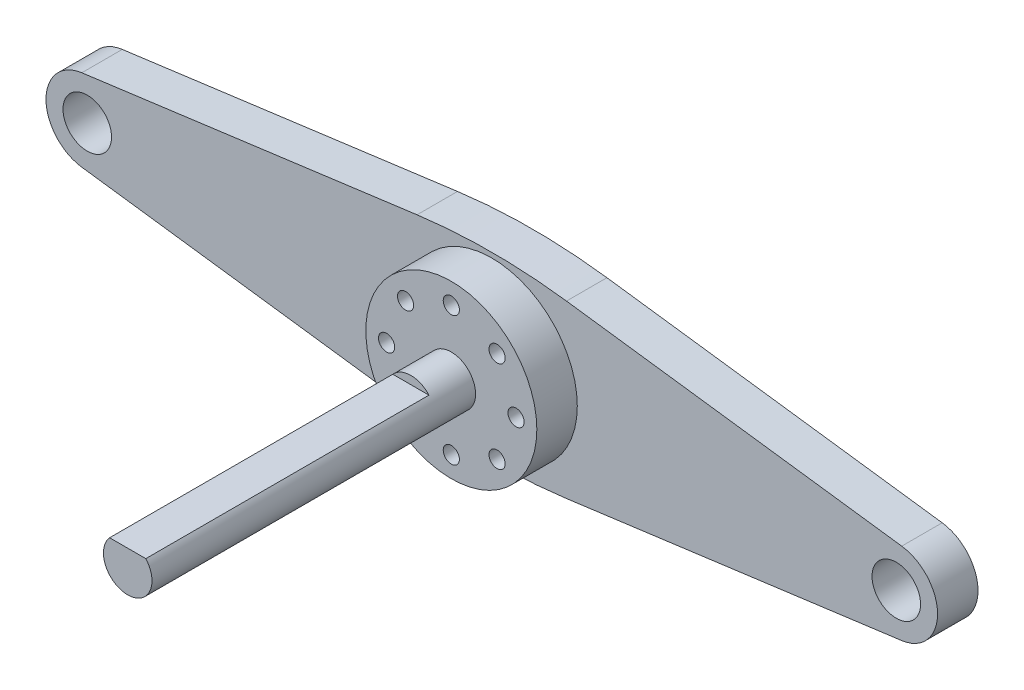
ISO-10303-21;
HEADER;
FILE_DESCRIPTION(('STEP AP214'),'2;1');
FILE_NAME('part.step','',(''),(''),'','','');
FILE_SCHEMA(('AUTOMOTIVE_DESIGN { 1 0 10303 214 1 1 1 1 }'));
ENDSEC;
DATA;
#1=APPLICATION_CONTEXT('core data for automotive mechanical design processes');
#2=APPLICATION_PROTOCOL_DEFINITION('international standard','automotive_design',2000,#1);
#3=PRODUCT_CONTEXT('',#1,'mechanical');
#4=PRODUCT('Part','Part','',(#3));
#5=PRODUCT_RELATED_PRODUCT_CATEGORY('part','',(#4));
#6=PRODUCT_DEFINITION_FORMATION('','',#4);
#7=PRODUCT_DEFINITION_CONTEXT('part definition',#1,'design');
#8=PRODUCT_DEFINITION('design','',#6,#7);
#9=PRODUCT_DEFINITION_SHAPE('','',#8);
#10=(LENGTH_UNIT() NAMED_UNIT(*) SI_UNIT(.MILLI.,.METRE.));
#11=(NAMED_UNIT(*) PLANE_ANGLE_UNIT() SI_UNIT($,.RADIAN.));
#12=(NAMED_UNIT(*) SI_UNIT($,.STERADIAN.) SOLID_ANGLE_UNIT());
#13=UNCERTAINTY_MEASURE_WITH_UNIT(LENGTH_MEASURE(1.E-05),#10,'distance_accuracy_value','');
#14=(GEOMETRIC_REPRESENTATION_CONTEXT(3) GLOBAL_UNCERTAINTY_ASSIGNED_CONTEXT((#13)) GLOBAL_UNIT_ASSIGNED_CONTEXT((#10,
#11,#12)) REPRESENTATION_CONTEXT('',''));
#15=CARTESIAN_POINT('',(0.,0.,0.));
#16=DIRECTION('',(0.,0.,1.));
#17=DIRECTION('',(1.,0.,0.));
#18=AXIS2_PLACEMENT_3D('',#15,#16,#17);
#19=CARTESIAN_POINT('',(-5.65685424949245,-5.65685424949231,5.));
#20=DIRECTION('',(0.,0.,-1.));
#21=DIRECTION('',(-1.,0.,0.));
#22=AXIS2_PLACEMENT_3D('',#19,#20,#21);
#23=CYLINDRICAL_SURFACE('',#22,1.);
#24=CARTESIAN_POINT('',(-5.65685424949245,-5.65685424949231,0.));
#25=DIRECTION('',(0.,0.,1.));
#26=DIRECTION('',(1.,0.,0.));
#27=AXIS2_PLACEMENT_3D('',#24,#25,#26);
#28=CIRCLE('',#27,1.);
#29=CARTESIAN_POINT('',(-4.65685424949245,-5.65685424949231,0.));
#30=VERTEX_POINT('',#29);
#31=EDGE_CURVE('E219',#30,#30,#28,.T.);
#32=ORIENTED_EDGE('',*,*,#31,.F.);
#33=EDGE_LOOP('',(#32));
#34=FACE_BOUND('',#33,.T.);
#35=CARTESIAN_POINT('',(-5.65685424949245,-5.65685424949231,10.));
#36=DIRECTION('',(0.,0.,1.));
#37=DIRECTION('',(1.,0.,0.));
#38=AXIS2_PLACEMENT_3D('',#35,#36,#37);
#39=CIRCLE('',#38,1.);
#40=CARTESIAN_POINT('',(-4.65685424949245,-5.65685424949231,10.));
#41=VERTEX_POINT('',#40);
#42=EDGE_CURVE('E262',#41,#41,#39,.T.);
#43=ORIENTED_EDGE('',*,*,#42,.T.);
#44=EDGE_LOOP('',(#43));
#45=FACE_BOUND('',#44,.T.);
#46=ADVANCED_FACE('F65',(#34,#45),#23,.F.);
#47=CARTESIAN_POINT('',(0.,-8.,5.));
#48=DIRECTION('',(0.,0.,-1.));
#49=DIRECTION('',(-1.,0.,0.));
#50=AXIS2_PLACEMENT_3D('',#47,#48,#49);
#51=CYLINDRICAL_SURFACE('',#50,1.);
#52=CARTESIAN_POINT('',(0.,-8.,0.));
#53=DIRECTION('',(0.,0.,1.));
#54=DIRECTION('',(1.,0.,0.));
#55=AXIS2_PLACEMENT_3D('',#52,#53,#54);
#56=CIRCLE('',#55,1.);
#57=CARTESIAN_POINT('',(0.999999999999915,-8.,0.));
#58=VERTEX_POINT('',#57);
#59=EDGE_CURVE('E216',#58,#58,#56,.T.);
#60=ORIENTED_EDGE('',*,*,#59,.F.);
#61=EDGE_LOOP('',(#60));
#62=FACE_BOUND('',#61,.T.);
#63=CARTESIAN_POINT('',(0.,-8.,10.));
#64=DIRECTION('',(0.,0.,1.));
#65=DIRECTION('',(1.,0.,0.));
#66=AXIS2_PLACEMENT_3D('',#63,#64,#65);
#67=CIRCLE('',#66,1.);
#68=CARTESIAN_POINT('',(0.999999999999915,-8.,10.));
#69=VERTEX_POINT('',#68);
#70=EDGE_CURVE('E265',#69,#69,#67,.T.);
#71=ORIENTED_EDGE('',*,*,#70,.T.);
#72=EDGE_LOOP('',(#71));
#73=FACE_BOUND('',#72,.T.);
#74=ADVANCED_FACE('F326',(#62,#73),#51,.F.);
#75=CARTESIAN_POINT('',(5.65685424949233,-5.65685424949243,5.));
#76=DIRECTION('',(0.,0.,-1.));
#77=DIRECTION('',(-1.,0.,0.));
#78=AXIS2_PLACEMENT_3D('',#75,#76,#77);
#79=CYLINDRICAL_SURFACE('',#78,1.);
#80=CARTESIAN_POINT('',(5.65685424949233,-5.65685424949243,0.));
#81=DIRECTION('',(0.,0.,1.));
#82=DIRECTION('',(1.,0.,0.));
#83=AXIS2_PLACEMENT_3D('',#80,#81,#82);
#84=CIRCLE('',#83,1.);
#85=CARTESIAN_POINT('',(6.65685424949233,-5.65685424949243,0.));
#86=VERTEX_POINT('',#85);
#87=EDGE_CURVE('E213',#86,#86,#84,.T.);
#88=ORIENTED_EDGE('',*,*,#87,.F.);
#89=EDGE_LOOP('',(#88));
#90=FACE_BOUND('',#89,.T.);
#91=CARTESIAN_POINT('',(5.65685424949233,-5.65685424949243,10.));
#92=DIRECTION('',(0.,0.,1.));
#93=DIRECTION('',(1.,0.,0.));
#94=AXIS2_PLACEMENT_3D('',#91,#92,#93);
#95=CIRCLE('',#94,1.);
#96=CARTESIAN_POINT('',(6.65685424949233,-5.65685424949243,10.));
#97=VERTEX_POINT('',#96);
#98=EDGE_CURVE('E268',#97,#97,#95,.T.);
#99=ORIENTED_EDGE('',*,*,#98,.T.);
#100=EDGE_LOOP('',(#99));
#101=FACE_BOUND('',#100,.T.);
#102=ADVANCED_FACE('F332',(#90,#101),#79,.F.);
#103=CARTESIAN_POINT('',(8.,0.,5.));
#104=DIRECTION('',(0.,0.,-1.));
#105=DIRECTION('',(-1.,0.,0.));
#106=AXIS2_PLACEMENT_3D('',#103,#104,#105);
#107=CYLINDRICAL_SURFACE('',#106,0.999999999999999);
#108=CARTESIAN_POINT('',(8.,0.,0.));
#109=DIRECTION('',(0.,0.,1.));
#110=DIRECTION('',(1.,0.,0.));
#111=AXIS2_PLACEMENT_3D('',#108,#109,#110);
#112=CIRCLE('',#111,0.999999999999999);
#113=CARTESIAN_POINT('',(9.,0.,0.));
#114=VERTEX_POINT('',#113);
#115=EDGE_CURVE('E210',#114,#114,#112,.T.);
#116=ORIENTED_EDGE('',*,*,#115,.F.);
#117=EDGE_LOOP('',(#116));
#118=FACE_BOUND('',#117,.T.);
#119=CARTESIAN_POINT('',(8.,0.,10.));
#120=DIRECTION('',(0.,0.,1.));
#121=DIRECTION('',(1.,0.,0.));
#122=AXIS2_PLACEMENT_3D('',#119,#120,#121);
#123=CIRCLE('',#122,0.999999999999999);
#124=CARTESIAN_POINT('',(9.,0.,10.));
#125=VERTEX_POINT('',#124);
#126=EDGE_CURVE('E271',#125,#125,#123,.T.);
#127=ORIENTED_EDGE('',*,*,#126,.T.);
#128=EDGE_LOOP('',(#127));
#129=FACE_BOUND('',#128,.T.);
#130=ADVANCED_FACE('F342',(#118,#129),#107,.F.);
#131=CARTESIAN_POINT('',(5.65685424949241,5.65685424949235,5.));
#132=DIRECTION('',(0.,0.,-1.));
#133=DIRECTION('',(-1.,0.,0.));
#134=AXIS2_PLACEMENT_3D('',#131,#132,#133);
#135=CYLINDRICAL_SURFACE('',#134,0.999999999999999);
#136=CARTESIAN_POINT('',(5.65685424949241,5.65685424949235,0.));
#137=DIRECTION('',(0.,0.,1.));
#138=DIRECTION('',(1.,0.,0.));
#139=AXIS2_PLACEMENT_3D('',#136,#137,#138);
#140=CIRCLE('',#139,0.999999999999999);
#141=CARTESIAN_POINT('',(6.65685424949241,5.65685424949235,0.));
#142=VERTEX_POINT('',#141);
#143=EDGE_CURVE('E207',#142,#142,#140,.T.);
#144=ORIENTED_EDGE('',*,*,#143,.F.);
#145=EDGE_LOOP('',(#144));
#146=FACE_BOUND('',#145,.T.);
#147=CARTESIAN_POINT('',(5.65685424949241,5.65685424949235,10.));
#148=DIRECTION('',(0.,0.,1.));
#149=DIRECTION('',(1.,0.,0.));
#150=AXIS2_PLACEMENT_3D('',#147,#148,#149);
#151=CIRCLE('',#150,0.999999999999999);
#152=CARTESIAN_POINT('',(6.65685424949241,5.65685424949235,10.));
#153=VERTEX_POINT('',#152);
#154=EDGE_CURVE('E274',#153,#153,#151,.T.);
#155=ORIENTED_EDGE('',*,*,#154,.T.);
#156=EDGE_LOOP('',(#155));
#157=FACE_BOUND('',#156,.T.);
#158=ADVANCED_FACE('F346',(#146,#157),#135,.F.);
#159=CARTESIAN_POINT('',(0.,8.,5.));
#160=DIRECTION('',(0.,0.,-1.));
#161=DIRECTION('',(-1.,0.,0.));
#162=AXIS2_PLACEMENT_3D('',#159,#160,#161);
#163=CYLINDRICAL_SURFACE('',#162,1.);
#164=CARTESIAN_POINT('',(0.,8.,0.));
#165=DIRECTION('',(0.,0.,1.));
#166=DIRECTION('',(1.,0.,0.));
#167=AXIS2_PLACEMENT_3D('',#164,#165,#166);
#168=CIRCLE('',#167,1.);
#169=CARTESIAN_POINT('',(1.00000000000003,8.,0.));
#170=VERTEX_POINT('',#169);
#171=EDGE_CURVE('E204',#170,#170,#168,.T.);
#172=ORIENTED_EDGE('',*,*,#171,.F.);
#173=EDGE_LOOP('',(#172));
#174=FACE_BOUND('',#173,.T.);
#175=CARTESIAN_POINT('',(0.,8.,10.));
#176=DIRECTION('',(0.,0.,1.));
#177=DIRECTION('',(1.,0.,0.));
#178=AXIS2_PLACEMENT_3D('',#175,#176,#177);
#179=CIRCLE('',#178,1.);
#180=CARTESIAN_POINT('',(1.00000000000003,8.,10.));
#181=VERTEX_POINT('',#180);
#182=EDGE_CURVE('E277',#181,#181,#179,.T.);
#183=ORIENTED_EDGE('',*,*,#182,.T.);
#184=EDGE_LOOP('',(#183));
#185=FACE_BOUND('',#184,.T.);
#186=ADVANCED_FACE('F350',(#174,#185),#163,.F.);
#187=CARTESIAN_POINT('',(-8.,0.,5.));
#188=DIRECTION('',(0.,0.,-1.));
#189=DIRECTION('',(-1.,0.,0.));
#190=AXIS2_PLACEMENT_3D('',#187,#188,#189);
#191=CYLINDRICAL_SURFACE('',#190,1.);
#192=CARTESIAN_POINT('',(-8.,0.,0.));
#193=DIRECTION('',(0.,0.,1.));
#194=DIRECTION('',(1.,0.,0.));
#195=AXIS2_PLACEMENT_3D('',#192,#193,#194);
#196=CIRCLE('',#195,1.);
#197=CARTESIAN_POINT('',(-7.,0.,0.));
#198=VERTEX_POINT('',#197);
#199=EDGE_CURVE('E201',#198,#198,#196,.T.);
#200=ORIENTED_EDGE('',*,*,#199,.F.);
#201=EDGE_LOOP('',(#200));
#202=FACE_BOUND('',#201,.T.);
#203=CARTESIAN_POINT('',(-8.,0.,10.));
#204=DIRECTION('',(0.,0.,1.));
#205=DIRECTION('',(1.,0.,0.));
#206=AXIS2_PLACEMENT_3D('',#203,#204,#205);
#207=CIRCLE('',#206,1.);
#208=CARTESIAN_POINT('',(-7.,0.,10.));
#209=VERTEX_POINT('',#208);
#210=EDGE_CURVE('E280',#209,#209,#207,.T.);
#211=ORIENTED_EDGE('',*,*,#210,.T.);
#212=EDGE_LOOP('',(#211));
#213=FACE_BOUND('',#212,.T.);
#214=ADVANCED_FACE('F354',(#202,#213),#191,.F.);
#215=CARTESIAN_POINT('',(-5.65685424949237,5.65685424949239,5.));
#216=DIRECTION('',(0.,0.,-1.));
#217=DIRECTION('',(-1.,0.,0.));
#218=AXIS2_PLACEMENT_3D('',#215,#216,#217);
#219=CYLINDRICAL_SURFACE('',#218,0.999999999999999);
#220=CARTESIAN_POINT('',(-5.65685424949237,5.65685424949239,0.));
#221=DIRECTION('',(0.,0.,1.));
#222=DIRECTION('',(1.,0.,0.));
#223=AXIS2_PLACEMENT_3D('',#220,#221,#222);
#224=CIRCLE('',#223,0.999999999999999);
#225=CARTESIAN_POINT('',(-4.65685424949237,5.65685424949239,0.));
#226=VERTEX_POINT('',#225);
#227=EDGE_CURVE('E198',#226,#226,#224,.T.);
#228=ORIENTED_EDGE('',*,*,#227,.F.);
#229=EDGE_LOOP('',(#228));
#230=FACE_BOUND('',#229,.T.);
#231=CARTESIAN_POINT('',(-5.65685424949237,5.65685424949239,10.));
#232=DIRECTION('',(0.,0.,1.));
#233=DIRECTION('',(1.,0.,0.));
#234=AXIS2_PLACEMENT_3D('',#231,#232,#233);
#235=CIRCLE('',#234,0.999999999999999);
#236=CARTESIAN_POINT('',(-4.65685424949237,5.65685424949239,10.));
#237=VERTEX_POINT('',#236);
#238=EDGE_CURVE('E283',#237,#237,#235,.T.);
#239=ORIENTED_EDGE('',*,*,#238,.T.);
#240=EDGE_LOOP('',(#239));
#241=FACE_BOUND('',#240,.T.);
#242=ADVANCED_FACE('F358',(#230,#241),#219,.F.);
#243=CARTESIAN_POINT('',(0.,58.8173671567806,5.));
#244=DIRECTION('',(0.,0.,-1.));
#245=DIRECTION('',(-1.,0.,0.));
#246=AXIS2_PLACEMENT_3D('',#243,#244,#245);
#247=CYLINDRICAL_SURFACE('',#246,70.);
#248=CARTESIAN_POINT('',(0.,58.8173671567806,0.));
#249=DIRECTION('',(0.,0.,1.));
#250=DIRECTION('',(1.,0.,0.));
#251=AXIS2_PLACEMENT_3D('',#248,#249,#250);
#252=CIRCLE('',#251,70.);
#253=CARTESIAN_POINT('',(-9.23511167640649,-10.5707637614413,0.));
#254=VERTEX_POINT('',#253);
#255=CARTESIAN_POINT('',(9.23511167640649,-10.5707637614413,0.));
#256=VERTEX_POINT('',#255);
#257=EDGE_CURVE('E182',#254,#256,#252,.T.);
#258=ORIENTED_EDGE('',*,*,#257,.T.);
#259=DIRECTION('',(0.,0.,-1.));
#260=VECTOR('',#259,1.);
#261=CARTESIAN_POINT('',(9.23511167640649,-10.5707637614413,5.));
#262=LINE('',#261,#260);
#263=CARTESIAN_POINT('',(9.23511167640649,-10.5707637614413,5.));
#264=VERTEX_POINT('',#263);
#265=EDGE_CURVE('E74',#264,#256,#262,.T.);
#266=ORIENTED_EDGE('',*,*,#265,.F.);
#267=CARTESIAN_POINT('',(0.,58.8173671567806,5.));
#268=DIRECTION('',(0.,0.,1.));
#269=DIRECTION('',(1.,0.,0.));
#270=AXIS2_PLACEMENT_3D('',#267,#268,#269);
#271=CIRCLE('',#270,70.);
#272=CARTESIAN_POINT('',(-9.23511167640649,-10.5707637614413,5.));
#273=VERTEX_POINT('',#272);
#274=EDGE_CURVE('E130',#273,#264,#271,.T.);
#275=ORIENTED_EDGE('',*,*,#274,.F.);
#276=DIRECTION('',(0.,0.,-1.));
#277=VECTOR('',#276,1.);
#278=CARTESIAN_POINT('',(-9.23511167640649,-10.5707637614413,5.));
#279=LINE('',#278,#277);
#280=EDGE_CURVE('E12',#273,#254,#279,.T.);
#281=ORIENTED_EDGE('',*,*,#280,.T.);
#282=EDGE_LOOP('',(#258,#266,#275,#281));
#283=FACE_BOUND('',#282,.T.);
#284=ADVANCED_FACE('F236',(#283),#247,.T.);
#285=CARTESIAN_POINT('',(1.54315479575544,-11.5945134987938,5.));
#286=DIRECTION('',(0.131930166805804,-0.991259013117456,0.));
#287=DIRECTION('',(0.991259013117456,0.131930166805804,0.));
#288=AXIS2_PLACEMENT_3D('',#285,#286,#287);
#289=PLANE('',#288);
#290=DIRECTION('',(-0.991259013117456,-0.131930166805804,0.));
#291=VECTOR('',#290,1.);
#292=CARTESIAN_POINT('',(1.54315479575544,-11.5945134987938,0.));
#293=LINE('',#292,#291);
#294=CARTESIAN_POINT('',(50.6728763500851,-5.05566515137672,0.));
#295=VERTEX_POINT('',#294);
#296=EDGE_CURVE('E185',#295,#256,#293,.T.);
#297=ORIENTED_EDGE('',*,*,#296,.F.);
#298=DIRECTION('',(0.,0.,-1.));
#299=VECTOR('',#298,1.);
#300=CARTESIAN_POINT('',(50.6728763500851,-5.05566515137672,5.));
#301=LINE('',#300,#299);
#302=CARTESIAN_POINT('',(50.6728763500851,-5.05566515137672,5.));
#303=VERTEX_POINT('',#302);
#304=EDGE_CURVE('E228',#303,#295,#301,.T.);
#305=ORIENTED_EDGE('',*,*,#304,.F.);
#306=DIRECTION('',(-0.991259013117456,-0.131930166805804,0.));
#307=VECTOR('',#306,1.);
#308=CARTESIAN_POINT('',(1.54315479575544,-11.5945134987938,5.));
#309=LINE('',#308,#307);
#310=EDGE_CURVE('E235',#303,#264,#309,.T.);
#311=ORIENTED_EDGE('',*,*,#310,.T.);
#312=ORIENTED_EDGE('',*,*,#265,.T.);
#313=EDGE_LOOP('',(#297,#305,#311,#312));
#314=FACE_BOUND('',#313,.T.);
#315=ADVANCED_FACE('F233',(#314),#289,.T.);
#316=CARTESIAN_POINT('',(50.,0.,5.));
#317=DIRECTION('',(0.,0.,-1.));
#318=DIRECTION('',(-1.,0.,0.));
#319=AXIS2_PLACEMENT_3D('',#316,#317,#318);
#320=CYLINDRICAL_SURFACE('',#319,5.10024633771241);
#321=CARTESIAN_POINT('',(50.,0.,0.));
#322=DIRECTION('',(0.,0.,1.));
#323=DIRECTION('',(1.,0.,0.));
#324=AXIS2_PLACEMENT_3D('',#321,#322,#323);
#325=CIRCLE('',#324,5.10024633771241);
#326=CARTESIAN_POINT('',(50.6728763500851,5.05566515137672,0.));
#327=VERTEX_POINT('',#326);
#328=EDGE_CURVE('E188',#327,#295,#325,.F.);
#329=ORIENTED_EDGE('',*,*,#328,.F.);
#330=DIRECTION('',(0.,0.,-1.));
#331=VECTOR('',#330,1.);
#332=CARTESIAN_POINT('',(50.6728763500851,5.05566515137672,5.));
#333=LINE('',#332,#331);
#334=CARTESIAN_POINT('',(50.6728763500851,5.05566515137672,5.));
#335=VERTEX_POINT('',#334);
#336=EDGE_CURVE('E226',#335,#327,#333,.T.);
#337=ORIENTED_EDGE('',*,*,#336,.F.);
#338=CARTESIAN_POINT('',(50.,0.,5.));
#339=DIRECTION('',(0.,0.,1.));
#340=DIRECTION('',(1.,0.,0.));
#341=AXIS2_PLACEMENT_3D('',#338,#339,#340);
#342=CIRCLE('',#341,5.10024633771241);
#343=EDGE_CURVE('E247',#335,#303,#342,.F.);
#344=ORIENTED_EDGE('',*,*,#343,.T.);
#345=ORIENTED_EDGE('',*,*,#304,.T.);
#346=EDGE_LOOP('',(#329,#337,#344,#345));
#347=FACE_BOUND('',#346,.T.);
#348=ADVANCED_FACE('F245',(#347),#320,.T.);
#349=CARTESIAN_POINT('',(1.54315479575544,11.5945134987938,5.));
#350=DIRECTION('',(-0.131930166805804,-0.991259013117456,0.));
#351=DIRECTION('',(0.991259013117456,-0.131930166805804,0.));
#352=AXIS2_PLACEMENT_3D('',#349,#350,#351);
#353=PLANE('',#352);
#354=DIRECTION('',(-0.991259013117456,0.131930166805804,0.));
#355=VECTOR('',#354,1.);
#356=CARTESIAN_POINT('',(1.54315479575544,11.5945134987938,0.));
#357=LINE('',#356,#355);
#358=CARTESIAN_POINT('',(9.23511167640649,10.5707637614413,0.));
#359=VERTEX_POINT('',#358);
#360=EDGE_CURVE('E191',#327,#359,#357,.T.);
#361=ORIENTED_EDGE('',*,*,#360,.T.);
#362=DIRECTION('',(0.,0.,-1.));
#363=VECTOR('',#362,1.);
#364=CARTESIAN_POINT('',(9.23511167640649,10.5707637614413,5.));
#365=LINE('',#364,#363);
#366=CARTESIAN_POINT('',(9.23511167640649,10.5707637614413,5.));
#367=VERTEX_POINT('',#366);
#368=EDGE_CURVE('E157',#367,#359,#365,.T.);
#369=ORIENTED_EDGE('',*,*,#368,.F.);
#370=DIRECTION('',(-0.991259013117456,0.131930166805804,0.));
#371=VECTOR('',#370,1.);
#372=CARTESIAN_POINT('',(1.54315479575544,11.5945134987938,5.));
#373=LINE('',#372,#371);
#374=EDGE_CURVE('E164',#335,#367,#373,.T.);
#375=ORIENTED_EDGE('',*,*,#374,.F.);
#376=ORIENTED_EDGE('',*,*,#336,.T.);
#377=EDGE_LOOP('',(#361,#369,#375,#376));
#378=FACE_BOUND('',#377,.T.);
#379=ADVANCED_FACE('F371',(#378),#353,.F.);
#380=CARTESIAN_POINT('',(0.,-58.8173671567806,5.));
#381=DIRECTION('',(0.,0.,-1.));
#382=DIRECTION('',(-1.,0.,0.));
#383=AXIS2_PLACEMENT_3D('',#380,#381,#382);
#384=CYLINDRICAL_SURFACE('',#383,70.);
#385=CARTESIAN_POINT('',(0.,-58.8173671567806,0.));
#386=DIRECTION('',(0.,0.,1.));
#387=DIRECTION('',(1.,0.,0.));
#388=AXIS2_PLACEMENT_3D('',#385,#386,#387);
#389=CIRCLE('',#388,70.);
#390=CARTESIAN_POINT('',(-9.23511167640649,10.5707637614413,0.));
#391=VERTEX_POINT('',#390);
#392=EDGE_CURVE('E152',#391,#359,#389,.F.);
#393=ORIENTED_EDGE('',*,*,#392,.F.);
#394=DIRECTION('',(0.,0.,-1.));
#395=VECTOR('',#394,1.);
#396=CARTESIAN_POINT('',(-9.23511167640649,10.5707637614413,5.));
#397=LINE('',#396,#395);
#398=CARTESIAN_POINT('',(-9.23511167640649,10.5707637614413,5.));
#399=VERTEX_POINT('',#398);
#400=EDGE_CURVE('E147',#399,#391,#397,.T.);
#401=ORIENTED_EDGE('',*,*,#400,.F.);
#402=CARTESIAN_POINT('',(0.,-58.8173671567806,5.));
#403=DIRECTION('',(0.,0.,1.));
#404=DIRECTION('',(1.,0.,0.));
#405=AXIS2_PLACEMENT_3D('',#402,#403,#404);
#406=CIRCLE('',#405,70.);
#407=EDGE_CURVE('E150',#399,#367,#406,.F.);
#408=ORIENTED_EDGE('',*,*,#407,.T.);
#409=ORIENTED_EDGE('',*,*,#368,.T.);
#410=EDGE_LOOP('',(#393,#401,#408,#409));
#411=FACE_BOUND('',#410,.T.);
#412=ADVANCED_FACE('F149',(#411),#384,.T.);
#413=CARTESIAN_POINT('',(-1.54315479575544,11.5945134987938,5.));
#414=DIRECTION('',(-0.131930166805804,0.991259013117456,0.));
#415=DIRECTION('',(-0.991259013117456,-0.131930166805804,0.));
#416=AXIS2_PLACEMENT_3D('',#413,#414,#415);
#417=PLANE('',#416);
#418=DIRECTION('',(0.991259013117456,0.131930166805804,0.));
#419=VECTOR('',#418,1.);
#420=CARTESIAN_POINT('',(-1.54315479575544,11.5945134987938,0.));
#421=LINE('',#420,#419);
#422=CARTESIAN_POINT('',(-50.6728763500851,5.05566515137672,0.));
#423=VERTEX_POINT('',#422);
#424=EDGE_CURVE('E195',#423,#391,#421,.T.);
#425=ORIENTED_EDGE('',*,*,#424,.F.);
#426=DIRECTION('',(0.,0.,-1.));
#427=VECTOR('',#426,1.);
#428=CARTESIAN_POINT('',(-50.6728763500851,5.05566515137672,5.));
#429=LINE('',#428,#427);
#430=CARTESIAN_POINT('',(-50.6728763500851,5.05566515137672,5.));
#431=VERTEX_POINT('',#430);
#432=EDGE_CURVE('E158',#431,#423,#429,.T.);
#433=ORIENTED_EDGE('',*,*,#432,.F.);
#434=DIRECTION('',(0.991259013117456,0.131930166805804,0.));
#435=VECTOR('',#434,1.);
#436=CARTESIAN_POINT('',(-1.54315479575544,11.5945134987938,5.));
#437=LINE('',#436,#435);
#438=EDGE_CURVE('E161',#431,#399,#437,.T.);
#439=ORIENTED_EDGE('',*,*,#438,.T.);
#440=ORIENTED_EDGE('',*,*,#400,.T.);
#441=EDGE_LOOP('',(#425,#433,#439,#440));
#442=FACE_BOUND('',#441,.T.);
#443=ADVANCED_FACE('F167',(#442),#417,.T.);
#444=CARTESIAN_POINT('',(-50.,0.,5.));
#445=DIRECTION('',(0.,0.,-1.));
#446=DIRECTION('',(-1.,0.,0.));
#447=AXIS2_PLACEMENT_3D('',#444,#445,#446);
#448=CYLINDRICAL_SURFACE('',#447,5.10024633771241);
#449=CARTESIAN_POINT('',(-50.,0.,0.));
#450=DIRECTION('',(0.,0.,1.));
#451=DIRECTION('',(1.,0.,0.));
#452=AXIS2_PLACEMENT_3D('',#449,#450,#451);
#453=CIRCLE('',#452,5.10024633771241);
#454=CARTESIAN_POINT('',(-50.6728763500851,-5.05566515137672,0.));
#455=VERTEX_POINT('',#454);
#456=EDGE_CURVE('E122',#423,#455,#453,.T.);
#457=ORIENTED_EDGE('',*,*,#456,.T.);
#458=DIRECTION('',(0.,0.,-1.));
#459=VECTOR('',#458,1.);
#460=CARTESIAN_POINT('',(-50.6728763500851,-5.05566515137672,5.));
#461=LINE('',#460,#459);
#462=CARTESIAN_POINT('',(-50.6728763500851,-5.05566515137672,5.));
#463=VERTEX_POINT('',#462);
#464=EDGE_CURVE('E169',#463,#455,#461,.T.);
#465=ORIENTED_EDGE('',*,*,#464,.F.);
#466=CARTESIAN_POINT('',(-50.,0.,5.));
#467=DIRECTION('',(0.,0.,1.));
#468=DIRECTION('',(1.,0.,0.));
#469=AXIS2_PLACEMENT_3D('',#466,#467,#468);
#470=CIRCLE('',#469,5.10024633771241);
#471=EDGE_CURVE('E89',#431,#463,#470,.T.);
#472=ORIENTED_EDGE('',*,*,#471,.F.);
#473=ORIENTED_EDGE('',*,*,#432,.T.);
#474=EDGE_LOOP('',(#457,#465,#472,#473));
#475=FACE_BOUND('',#474,.T.);
#476=ADVANCED_FACE('F363',(#475),#448,.T.);
#477=CARTESIAN_POINT('',(-1.54315479575544,-11.5945134987938,5.));
#478=DIRECTION('',(0.131930166805804,0.991259013117456,0.));
#479=DIRECTION('',(-0.991259013117456,0.131930166805804,0.));
#480=AXIS2_PLACEMENT_3D('',#477,#478,#479);
#481=PLANE('',#480);
#482=DIRECTION('',(0.991259013117456,-0.131930166805804,0.));
#483=VECTOR('',#482,1.);
#484=CARTESIAN_POINT('',(-1.54315479575544,-11.5945134987938,0.));
#485=LINE('',#484,#483);
#486=EDGE_CURVE('E179',#455,#254,#485,.T.);
#487=ORIENTED_EDGE('',*,*,#486,.T.);
#488=ORIENTED_EDGE('',*,*,#280,.F.);
#489=DIRECTION('',(0.991259013117456,-0.131930166805804,0.));
#490=VECTOR('',#489,1.);
#491=CARTESIAN_POINT('',(-1.54315479575544,-11.5945134987938,5.));
#492=LINE('',#491,#490);
#493=EDGE_CURVE('E250',#463,#273,#492,.T.);
#494=ORIENTED_EDGE('',*,*,#493,.F.);
#495=ORIENTED_EDGE('',*,*,#464,.T.);
#496=EDGE_LOOP('',(#487,#488,#494,#495));
#497=FACE_BOUND('',#496,.T.);
#498=ADVANCED_FACE('F366',(#497),#481,.F.);
#499=CARTESIAN_POINT('',(-50.,0.,5.));
#500=DIRECTION('',(0.,0.,-1.));
#501=DIRECTION('',(-1.,0.,0.));
#502=AXIS2_PLACEMENT_3D('',#499,#500,#501);
#503=CYLINDRICAL_SURFACE('',#502,3.);
#504=CARTESIAN_POINT('',(-50.,0.,5.));
#505=DIRECTION('',(0.,0.,1.));
#506=DIRECTION('',(1.,0.,0.));
#507=AXIS2_PLACEMENT_3D('',#504,#505,#506);
#508=CIRCLE('',#507,3.);
#509=CARTESIAN_POINT('',(-47.,0.,5.));
#510=VERTEX_POINT('',#509);
#511=EDGE_CURVE('E254',#510,#510,#508,.T.);
#512=ORIENTED_EDGE('',*,*,#511,.T.);
#513=EDGE_LOOP('',(#512));
#514=FACE_BOUND('',#513,.T.);
#515=CARTESIAN_POINT('',(-50.,0.,0.));
#516=DIRECTION('',(0.,0.,1.));
#517=DIRECTION('',(1.,0.,0.));
#518=AXIS2_PLACEMENT_3D('',#515,#516,#517);
#519=CIRCLE('',#518,3.);
#520=CARTESIAN_POINT('',(-47.,0.,0.));
#521=VERTEX_POINT('',#520);
#522=EDGE_CURVE('E176',#521,#521,#519,.T.);
#523=ORIENTED_EDGE('',*,*,#522,.F.);
#524=EDGE_LOOP('',(#523));
#525=FACE_BOUND('',#524,.T.);
#526=ADVANCED_FACE('F382',(#514,#525),#503,.F.);
#527=CARTESIAN_POINT('',(50.,0.,5.));
#528=DIRECTION('',(0.,0.,-1.));
#529=DIRECTION('',(-1.,0.,0.));
#530=AXIS2_PLACEMENT_3D('',#527,#528,#529);
#531=CYLINDRICAL_SURFACE('',#530,3.);
#532=CARTESIAN_POINT('',(50.,0.,5.));
#533=DIRECTION('',(0.,0.,1.));
#534=DIRECTION('',(1.,0.,0.));
#535=AXIS2_PLACEMENT_3D('',#532,#533,#534);
#536=CIRCLE('',#535,3.);
#537=CARTESIAN_POINT('',(53.,0.,5.));
#538=VERTEX_POINT('',#537);
#539=EDGE_CURVE('E222',#538,#538,#536,.F.);
#540=ORIENTED_EDGE('',*,*,#539,.F.);
#541=EDGE_LOOP('',(#540));
#542=FACE_BOUND('',#541,.T.);
#543=CARTESIAN_POINT('',(50.,0.,0.));
#544=DIRECTION('',(0.,0.,1.));
#545=DIRECTION('',(1.,0.,0.));
#546=AXIS2_PLACEMENT_3D('',#543,#544,#545);
#547=CIRCLE('',#546,3.);
#548=CARTESIAN_POINT('',(53.,0.,0.));
#549=VERTEX_POINT('',#548);
#550=EDGE_CURVE('E173',#549,#549,#547,.F.);
#551=ORIENTED_EDGE('',*,*,#550,.T.);
#552=EDGE_LOOP('',(#551));
#553=FACE_BOUND('',#552,.T.);
#554=ADVANCED_FACE('F67',(#542,#553),#531,.F.);
#555=CARTESIAN_POINT('',(0.,0.,0.));
#556=DIRECTION('',(0.,0.,1.));
#557=DIRECTION('',(1.,0.,0.));
#558=AXIS2_PLACEMENT_3D('',#555,#556,#557);
#559=PLANE('',#558);
#560=ORIENTED_EDGE('',*,*,#550,.F.);
#561=EDGE_LOOP('',(#560));
#562=FACE_BOUND('',#561,.T.);
#563=ORIENTED_EDGE('',*,*,#522,.T.);
#564=EDGE_LOOP('',(#563));
#565=FACE_BOUND('',#564,.T.);
#566=ORIENTED_EDGE('',*,*,#486,.F.);
#567=ORIENTED_EDGE('',*,*,#456,.F.);
#568=ORIENTED_EDGE('',*,*,#424,.T.);
#569=ORIENTED_EDGE('',*,*,#392,.T.);
#570=ORIENTED_EDGE('',*,*,#360,.F.);
#571=ORIENTED_EDGE('',*,*,#328,.T.);
#572=ORIENTED_EDGE('',*,*,#296,.T.);
#573=ORIENTED_EDGE('',*,*,#257,.F.);
#574=EDGE_LOOP('',(#566,#567,#568,#569,#570,#571,#572,#573));
#575=FACE_BOUND('',#574,.T.);
#576=ORIENTED_EDGE('',*,*,#31,.T.);
#577=EDGE_LOOP('',(#576));
#578=FACE_BOUND('',#577,.T.);
#579=ORIENTED_EDGE('',*,*,#59,.T.);
#580=EDGE_LOOP('',(#579));
#581=FACE_BOUND('',#580,.T.);
#582=ORIENTED_EDGE('',*,*,#87,.T.);
#583=EDGE_LOOP('',(#582));
#584=FACE_BOUND('',#583,.T.);
#585=ORIENTED_EDGE('',*,*,#115,.T.);
#586=EDGE_LOOP('',(#585));
#587=FACE_BOUND('',#586,.T.);
#588=ORIENTED_EDGE('',*,*,#143,.T.);
#589=EDGE_LOOP('',(#588));
#590=FACE_BOUND('',#589,.T.);
#591=ORIENTED_EDGE('',*,*,#171,.T.);
#592=EDGE_LOOP('',(#591));
#593=FACE_BOUND('',#592,.T.);
#594=ORIENTED_EDGE('',*,*,#199,.T.);
#595=EDGE_LOOP('',(#594));
#596=FACE_BOUND('',#595,.T.);
#597=ORIENTED_EDGE('',*,*,#227,.T.);
#598=EDGE_LOOP('',(#597));
#599=FACE_BOUND('',#598,.T.);
#600=ADVANCED_FACE('F240',(#562,#565,#575,#578,#581,#584,#587,#590,#593,#596,#599),#559,.F.);
#601=CARTESIAN_POINT('',(0.,0.,5.));
#602=DIRECTION('',(0.,0.,1.));
#603=DIRECTION('',(1.,0.,0.));
#604=AXIS2_PLACEMENT_3D('',#601,#602,#603);
#605=PLANE('',#604);
#606=CARTESIAN_POINT('',(0.,0.,5.));
#607=DIRECTION('',(0.,0.,1.));
#608=DIRECTION('',(1.,0.,0.));
#609=AXIS2_PLACEMENT_3D('',#606,#607,#608);
#610=CIRCLE('',#609,10.5707637614413);
#611=CARTESIAN_POINT('',(10.5707637614413,0.,5.));
#612=VERTEX_POINT('',#611);
#613=EDGE_CURVE('E69',#612,#612,#610,.F.);
#614=ORIENTED_EDGE('',*,*,#613,.T.);
#615=EDGE_LOOP('',(#614));
#616=FACE_BOUND('',#615,.T.);
#617=ORIENTED_EDGE('',*,*,#539,.T.);
#618=EDGE_LOOP('',(#617));
#619=FACE_BOUND('',#618,.T.);
#620=ORIENTED_EDGE('',*,*,#511,.F.);
#621=EDGE_LOOP('',(#620));
#622=FACE_BOUND('',#621,.T.);
#623=ORIENTED_EDGE('',*,*,#493,.T.);
#624=ORIENTED_EDGE('',*,*,#274,.T.);
#625=ORIENTED_EDGE('',*,*,#310,.F.);
#626=ORIENTED_EDGE('',*,*,#343,.F.);
#627=ORIENTED_EDGE('',*,*,#374,.T.);
#628=ORIENTED_EDGE('',*,*,#407,.F.);
#629=ORIENTED_EDGE('',*,*,#438,.F.);
#630=ORIENTED_EDGE('',*,*,#471,.T.);
#631=EDGE_LOOP('',(#623,#624,#625,#626,#627,#628,#629,#630));
#632=FACE_BOUND('',#631,.T.);
#633=ADVANCED_FACE('F160',(#616,#619,#622,#632),#605,.T.);
#634=CARTESIAN_POINT('',(0.,0.,10.));
#635=DIRECTION('',(0.,0.,-1.));
#636=DIRECTION('',(-1.,0.,0.));
#637=AXIS2_PLACEMENT_3D('',#634,#635,#636);
#638=CYLINDRICAL_SURFACE('',#637,10.5707637614413);
#639=ORIENTED_EDGE('',*,*,#613,.F.);
#640=EDGE_LOOP('',(#639));
#641=FACE_BOUND('',#640,.T.);
#642=CARTESIAN_POINT('',(0.,0.,10.));
#643=DIRECTION('',(0.,0.,1.));
#644=DIRECTION('',(1.,0.,0.));
#645=AXIS2_PLACEMENT_3D('',#642,#643,#644);
#646=CIRCLE('',#645,10.5707637614413);
#647=CARTESIAN_POINT('',(10.5707637614413,0.,10.));
#648=VERTEX_POINT('',#647);
#649=EDGE_CURVE('E259',#648,#648,#646,.T.);
#650=ORIENTED_EDGE('',*,*,#649,.F.);
#651=EDGE_LOOP('',(#650));
#652=FACE_BOUND('',#651,.T.);
#653=ADVANCED_FACE('F399',(#641,#652),#638,.T.);
#654=CARTESIAN_POINT('',(0.,0.,10.));
#655=DIRECTION('',(0.,0.,1.));
#656=DIRECTION('',(1.,0.,0.));
#657=AXIS2_PLACEMENT_3D('',#654,#655,#656);
#658=PLANE('',#657);
#659=CARTESIAN_POINT('',(0.,0.,10.));
#660=DIRECTION('',(0.,0.,1.));
#661=DIRECTION('',(1.,0.,0.));
#662=AXIS2_PLACEMENT_3D('',#659,#660,#661);
#663=CIRCLE('',#662,3.);
#664=CARTESIAN_POINT('',(3.,0.,10.));
#665=VERTEX_POINT('',#664);
#666=EDGE_CURVE('E286',#665,#665,#663,.T.);
#667=ORIENTED_EDGE('',*,*,#666,.F.);
#668=EDGE_LOOP('',(#667));
#669=FACE_BOUND('',#668,.T.);
#670=ORIENTED_EDGE('',*,*,#238,.F.);
#671=EDGE_LOOP('',(#670));
#672=FACE_BOUND('',#671,.T.);
#673=ORIENTED_EDGE('',*,*,#210,.F.);
#674=EDGE_LOOP('',(#673));
#675=FACE_BOUND('',#674,.T.);
#676=ORIENTED_EDGE('',*,*,#182,.F.);
#677=EDGE_LOOP('',(#676));
#678=FACE_BOUND('',#677,.T.);
#679=ORIENTED_EDGE('',*,*,#154,.F.);
#680=EDGE_LOOP('',(#679));
#681=FACE_BOUND('',#680,.T.);
#682=ORIENTED_EDGE('',*,*,#126,.F.);
#683=EDGE_LOOP('',(#682));
#684=FACE_BOUND('',#683,.T.);
#685=ORIENTED_EDGE('',*,*,#98,.F.);
#686=EDGE_LOOP('',(#685));
#687=FACE_BOUND('',#686,.T.);
#688=ORIENTED_EDGE('',*,*,#70,.F.);
#689=EDGE_LOOP('',(#688));
#690=FACE_BOUND('',#689,.T.);
#691=ORIENTED_EDGE('',*,*,#42,.F.);
#692=EDGE_LOOP('',(#691));
#693=FACE_BOUND('',#692,.T.);
#694=ORIENTED_EDGE('',*,*,#649,.T.);
#695=EDGE_LOOP('',(#694));
#696=FACE_BOUND('',#695,.T.);
#697=ADVANCED_FACE('F406',(#669,#672,#675,#678,#681,#684,#687,#690,#693,#696),#658,.T.);
#698=CARTESIAN_POINT('',(0.,2.,50.));
#699=DIRECTION('',(0.,-1.,0.));
#700=DIRECTION('',(1.,0.,0.));
#701=AXIS2_PLACEMENT_3D('',#698,#699,#700);
#702=PLANE('',#701);
#703=DIRECTION('',(0.,0.,-1.));
#704=VECTOR('',#703,1.);
#705=CARTESIAN_POINT('',(2.23606797749979,2.,50.));
#706=LINE('',#705,#704);
#707=CARTESIAN_POINT('',(2.23606797749979,2.,50.));
#708=VERTEX_POINT('',#707);
#709=CARTESIAN_POINT('',(2.23606797749979,2.,15.));
#710=VERTEX_POINT('',#709);
#711=EDGE_CURVE('E292',#708,#710,#706,.T.);
#712=ORIENTED_EDGE('',*,*,#711,.T.);
#713=DIRECTION('',(-1.,0.,0.));
#714=VECTOR('',#713,1.);
#715=CARTESIAN_POINT('',(0.,2.,15.));
#716=LINE('',#715,#714);
#717=CARTESIAN_POINT('',(-2.23606797749979,2.,15.));
#718=VERTEX_POINT('',#717);
#719=EDGE_CURVE('E301',#710,#718,#716,.T.);
#720=ORIENTED_EDGE('',*,*,#719,.T.);
#721=DIRECTION('',(0.,0.,-1.));
#722=VECTOR('',#721,1.);
#723=CARTESIAN_POINT('',(-2.23606797749979,2.,50.));
#724=LINE('',#723,#722);
#725=CARTESIAN_POINT('',(-2.23606797749979,2.,50.));
#726=VERTEX_POINT('',#725);
#727=EDGE_CURVE('E289',#726,#718,#724,.T.);
#728=ORIENTED_EDGE('',*,*,#727,.F.);
#729=DIRECTION('',(-1.,0.,0.));
#730=VECTOR('',#729,1.);
#731=CARTESIAN_POINT('',(0.,2.,50.));
#732=LINE('',#731,#730);
#733=EDGE_CURVE('E298',#708,#726,#732,.T.);
#734=ORIENTED_EDGE('',*,*,#733,.F.);
#735=EDGE_LOOP('',(#712,#720,#728,#734));
#736=FACE_BOUND('',#735,.T.);
#737=ADVANCED_FACE('F305',(#736),#702,.F.);
#738=CARTESIAN_POINT('',(0.,0.,50.));
#739=DIRECTION('',(0.,0.,-1.));
#740=DIRECTION('',(-1.,0.,0.));
#741=AXIS2_PLACEMENT_3D('',#738,#739,#740);
#742=CYLINDRICAL_SURFACE('',#741,3.);
#743=ORIENTED_EDGE('',*,*,#666,.T.);
#744=EDGE_LOOP('',(#743));
#745=FACE_BOUND('',#744,.T.);
#746=ORIENTED_EDGE('',*,*,#727,.T.);
#747=CARTESIAN_POINT('',(0.,0.,15.));
#748=DIRECTION('',(0.,0.,1.));
#749=DIRECTION('',(1.,0.,0.));
#750=AXIS2_PLACEMENT_3D('',#747,#748,#749);
#751=CIRCLE('',#750,3.);
#752=EDGE_CURVE('E80',#710,#718,#751,.T.);
#753=ORIENTED_EDGE('',*,*,#752,.F.);
#754=ORIENTED_EDGE('',*,*,#711,.F.);
#755=CARTESIAN_POINT('',(0.,0.,50.));
#756=DIRECTION('',(0.,0.,1.));
#757=DIRECTION('',(1.,0.,0.));
#758=AXIS2_PLACEMENT_3D('',#755,#756,#757);
#759=CIRCLE('',#758,3.);
#760=EDGE_CURVE('E295',#726,#708,#759,.T.);
#761=ORIENTED_EDGE('',*,*,#760,.F.);
#762=EDGE_LOOP('',(#746,#753,#754,#761));
#763=FACE_BOUND('',#762,.T.);
#764=ADVANCED_FACE('F312',(#745,#763),#742,.T.);
#765=CARTESIAN_POINT('',(0.,0.,50.));
#766=DIRECTION('',(0.,0.,1.));
#767=DIRECTION('',(1.,0.,0.));
#768=AXIS2_PLACEMENT_3D('',#765,#766,#767);
#769=PLANE('',#768);
#770=ORIENTED_EDGE('',*,*,#733,.T.);
#771=ORIENTED_EDGE('',*,*,#760,.T.);
#772=EDGE_LOOP('',(#770,#771));
#773=FACE_BOUND('',#772,.T.);
#774=ADVANCED_FACE('F314',(#773),#769,.T.);
#775=CARTESIAN_POINT('',(0.,0.,15.));
#776=DIRECTION('',(0.,0.,1.));
#777=DIRECTION('',(1.,0.,0.));
#778=AXIS2_PLACEMENT_3D('',#775,#776,#777);
#779=PLANE('',#778);
#780=ORIENTED_EDGE('',*,*,#719,.F.);
#781=ORIENTED_EDGE('',*,*,#752,.T.);
#782=EDGE_LOOP('',(#780,#781));
#783=FACE_BOUND('',#782,.T.);
#784=ADVANCED_FACE('F316',(#783),#779,.T.);
#785=CLOSED_SHELL('',(#46,#74,#102,#130,#158,#186,#214,#242,#284,#315,#348,#379,#412,#443,#476,
#498,#526,#554,#600,#633,#653,#697,#737,#764,#774,#784));
#786=MANIFOLD_SOLID_BREP('B2',#785);
#787=ADVANCED_BREP_SHAPE_REPRESENTATION('',(#18,#786),#14);
#788=SHAPE_DEFINITION_REPRESENTATION(#9,#787);
ENDSEC;
END-ISO-10303-21;
